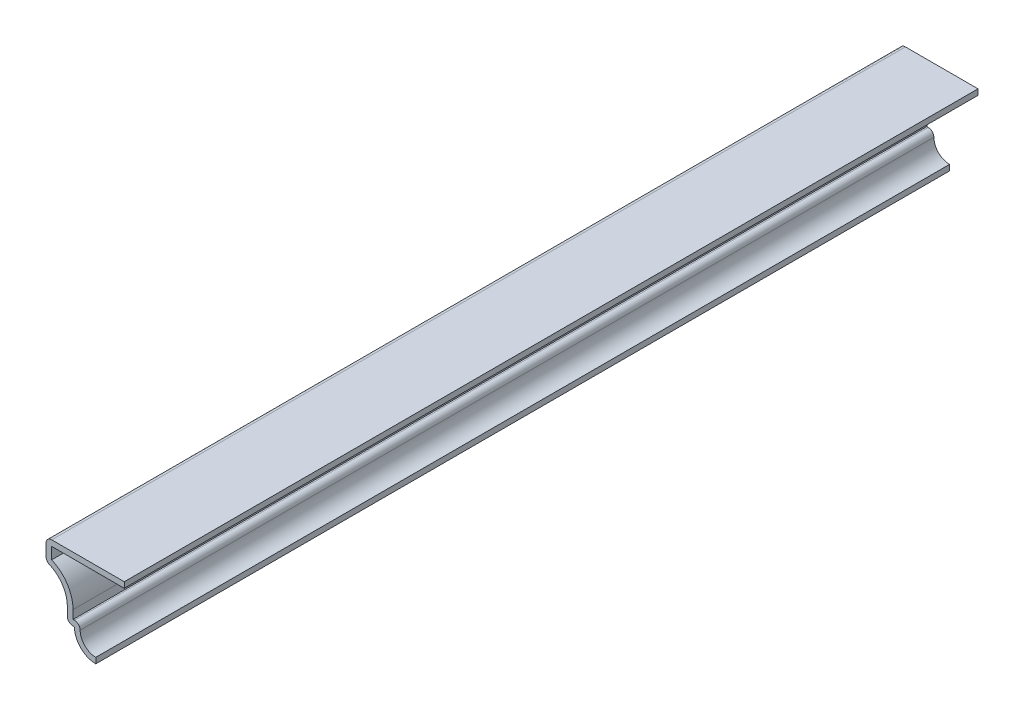
ISO-10303-21;
HEADER;
FILE_DESCRIPTION(('STEP AP214'),'2;1');
FILE_NAME('part.step','',(''),(''),'','','');
FILE_SCHEMA(('AUTOMOTIVE_DESIGN { 1 0 10303 214 1 1 1 1 }'));
ENDSEC;
DATA;
#1=APPLICATION_CONTEXT('core data for automotive mechanical design processes');
#2=APPLICATION_PROTOCOL_DEFINITION('international standard','automotive_design',2000,#1);
#3=PRODUCT_CONTEXT('',#1,'mechanical');
#4=PRODUCT('Part','Part','',(#3));
#5=PRODUCT_RELATED_PRODUCT_CATEGORY('part','',(#4));
#6=PRODUCT_DEFINITION_FORMATION('','',#4);
#7=PRODUCT_DEFINITION_CONTEXT('part definition',#1,'design');
#8=PRODUCT_DEFINITION('design','',#6,#7);
#9=PRODUCT_DEFINITION_SHAPE('','',#8);
#10=(LENGTH_UNIT() NAMED_UNIT(*) SI_UNIT(.MILLI.,.METRE.));
#11=(NAMED_UNIT(*) PLANE_ANGLE_UNIT() SI_UNIT($,.RADIAN.));
#12=(NAMED_UNIT(*) SI_UNIT($,.STERADIAN.) SOLID_ANGLE_UNIT());
#13=UNCERTAINTY_MEASURE_WITH_UNIT(LENGTH_MEASURE(1.E-05),#10,'distance_accuracy_value','');
#14=(GEOMETRIC_REPRESENTATION_CONTEXT(3) GLOBAL_UNCERTAINTY_ASSIGNED_CONTEXT((#13)) GLOBAL_UNIT_ASSIGNED_CONTEXT((#10,
#11,#12)) REPRESENTATION_CONTEXT('',''));
#15=CARTESIAN_POINT('',(0.,0.,0.));
#16=DIRECTION('',(0.,0.,1.));
#17=DIRECTION('',(1.,0.,0.));
#18=AXIS2_PLACEMENT_3D('',#15,#16,#17);
#19=CARTESIAN_POINT('',(0.,4.7625,-190.5));
#20=DIRECTION('',(0.,0.,1.));
#21=DIRECTION('',(1.,0.,0.));
#22=AXIS2_PLACEMENT_3D('',#19,#20,#21);
#23=CYLINDRICAL_SURFACE('',#22,4.7625);
#24=CARTESIAN_POINT('',(0.,4.7625,0.));
#25=DIRECTION('',(0.,0.,1.));
#26=DIRECTION('',(1.,0.,0.));
#27=AXIS2_PLACEMENT_3D('',#24,#25,#26);
#28=CIRCLE('',#27,4.7625);
#29=CARTESIAN_POINT('',(-4.7625,4.7625,0.));
#30=VERTEX_POINT('',#29);
#31=CARTESIAN_POINT('',(0.,0.,0.));
#32=VERTEX_POINT('',#31);
#33=EDGE_CURVE('E215',#30,#32,#28,.T.);
#34=ORIENTED_EDGE('',*,*,#33,.F.);
#35=DIRECTION('',(0.,0.,1.));
#36=VECTOR('',#35,1.);
#37=CARTESIAN_POINT('',(-4.7625,4.7625,-190.5));
#38=LINE('',#37,#36);
#39=CARTESIAN_POINT('',(-4.7625,4.7625,-190.5));
#40=VERTEX_POINT('',#39);
#41=EDGE_CURVE('E186',#40,#30,#38,.T.);
#42=ORIENTED_EDGE('',*,*,#41,.F.);
#43=CARTESIAN_POINT('',(0.,4.7625,-190.5));
#44=DIRECTION('',(0.,0.,1.));
#45=DIRECTION('',(1.,0.,0.));
#46=AXIS2_PLACEMENT_3D('',#43,#44,#45);
#47=CIRCLE('',#46,4.7625);
#48=CARTESIAN_POINT('',(0.,0.,-190.5));
#49=VERTEX_POINT('',#48);
#50=EDGE_CURVE('E166',#40,#49,#47,.T.);
#51=ORIENTED_EDGE('',*,*,#50,.T.);
#52=DIRECTION('',(0.,0.,1.));
#53=VECTOR('',#52,1.);
#54=CARTESIAN_POINT('',(0.,0.,-190.5));
#55=LINE('',#54,#53);
#56=EDGE_CURVE('E174',#49,#32,#55,.T.);
#57=ORIENTED_EDGE('',*,*,#56,.T.);
#58=EDGE_LOOP('',(#34,#42,#51,#57));
#59=FACE_BOUND('',#58,.T.);
#60=ADVANCED_FACE('F34',(#59),#23,.T.);
#61=CARTESIAN_POINT('',(-6.35,4.7625,-190.5));
#62=DIRECTION('',(0.,-1.,0.));
#63=DIRECTION('',(0.,0.,-1.));
#64=AXIS2_PLACEMENT_3D('',#61,#62,#63);
#65=PLANE('',#64);
#66=DIRECTION('',(1.,0.,0.));
#67=VECTOR('',#66,1.);
#68=CARTESIAN_POINT('',(-6.35,4.7625,0.));
#69=LINE('',#68,#67);
#70=CARTESIAN_POINT('',(-5.08,4.7625,0.));
#71=VERTEX_POINT('',#70);
#72=EDGE_CURVE('E187',#71,#30,#69,.T.);
#73=ORIENTED_EDGE('',*,*,#72,.F.);
#74=DIRECTION('',(0.,0.,1.));
#75=VECTOR('',#74,1.);
#76=CARTESIAN_POINT('',(-5.08,4.7625,-190.5));
#77=LINE('',#76,#75);
#78=CARTESIAN_POINT('',(-5.08,4.7625,-190.5));
#79=VERTEX_POINT('',#78);
#80=EDGE_CURVE('E287',#71,#79,#77,.F.);
#81=ORIENTED_EDGE('',*,*,#80,.T.);
#82=DIRECTION('',(1.,0.,0.));
#83=VECTOR('',#82,1.);
#84=CARTESIAN_POINT('',(-6.35,4.7625,-190.5));
#85=LINE('',#84,#83);
#86=EDGE_CURVE('E182',#79,#40,#85,.T.);
#87=ORIENTED_EDGE('',*,*,#86,.T.);
#88=ORIENTED_EDGE('',*,*,#41,.T.);
#89=EDGE_LOOP('',(#73,#81,#87,#88));
#90=FACE_BOUND('',#89,.T.);
#91=ADVANCED_FACE('F353',(#90),#65,.T.);
#92=CARTESIAN_POINT('',(-6.35,4.7625,-190.5));
#93=DIRECTION('',(-1.,0.,0.));
#94=DIRECTION('',(0.,-1.,0.));
#95=AXIS2_PLACEMENT_3D('',#92,#93,#94);
#96=PLANE('',#95);
#97=DIRECTION('',(0.,-1.,0.));
#98=VECTOR('',#97,1.);
#99=CARTESIAN_POINT('',(-6.35,4.7625,-190.5));
#100=LINE('',#99,#98);
#101=CARTESIAN_POINT('',(-6.35,7.9375,-190.5));
#102=VERTEX_POINT('',#101);
#103=CARTESIAN_POINT('',(-6.35,6.0325,-190.5));
#104=VERTEX_POINT('',#103);
#105=EDGE_CURVE('E211',#102,#104,#100,.T.);
#106=ORIENTED_EDGE('',*,*,#105,.T.);
#107=DIRECTION('',(0.,0.,1.));
#108=VECTOR('',#107,1.);
#109=CARTESIAN_POINT('',(-6.35,6.0325,-190.5));
#110=LINE('',#109,#108);
#111=CARTESIAN_POINT('',(-6.35,6.0325,0.));
#112=VERTEX_POINT('',#111);
#113=EDGE_CURVE('E284',#104,#112,#110,.T.);
#114=ORIENTED_EDGE('',*,*,#113,.T.);
#115=DIRECTION('',(0.,-1.,0.));
#116=VECTOR('',#115,1.);
#117=CARTESIAN_POINT('',(-6.35,4.7625,0.));
#118=LINE('',#117,#116);
#119=CARTESIAN_POINT('',(-6.35,7.9375,0.));
#120=VERTEX_POINT('',#119);
#121=EDGE_CURVE('E189',#120,#112,#118,.T.);
#122=ORIENTED_EDGE('',*,*,#121,.F.);
#123=DIRECTION('',(0.,0.,1.));
#124=VECTOR('',#123,1.);
#125=CARTESIAN_POINT('',(-6.35,7.9375,-190.5));
#126=LINE('',#125,#124);
#127=EDGE_CURVE('E245',#102,#120,#126,.T.);
#128=ORIENTED_EDGE('',*,*,#127,.F.);
#129=EDGE_LOOP('',(#106,#114,#122,#128));
#130=FACE_BOUND('',#129,.T.);
#131=ADVANCED_FACE('F360',(#130),#96,.T.);
#132=CARTESIAN_POINT('',(-12.9645833333333,7.9375,-190.5));
#133=DIRECTION('',(0.,0.,1.));
#134=DIRECTION('',(1.,0.,0.));
#135=AXIS2_PLACEMENT_3D('',#132,#133,#134);
#136=CYLINDRICAL_SURFACE('',#135,6.61458333333333);
#137=CARTESIAN_POINT('',(-12.9645833333333,7.9375,0.));
#138=DIRECTION('',(0.,0.,-1.));
#139=DIRECTION('',(-1.,0.,0.));
#140=AXIS2_PLACEMENT_3D('',#137,#138,#139);
#141=CIRCLE('',#140,6.61458333333333);
#142=CARTESIAN_POINT('',(-10.3453859060403,14.0114210984728,0.));
#143=VERTEX_POINT('',#142);
#144=EDGE_CURVE('E239',#143,#120,#141,.T.);
#145=ORIENTED_EDGE('',*,*,#144,.F.);
#146=DIRECTION('',(0.,0.,1.));
#147=VECTOR('',#146,1.);
#148=CARTESIAN_POINT('',(-10.3453859060403,14.0114210984728,-190.5));
#149=LINE('',#148,#147);
#150=CARTESIAN_POINT('',(-10.3453859060403,14.0114210984728,-190.5));
#151=VERTEX_POINT('',#150);
#152=EDGE_CURVE('E42',#143,#151,#149,.F.);
#153=ORIENTED_EDGE('',*,*,#152,.T.);
#154=CARTESIAN_POINT('',(-12.9645833333333,7.9375,-190.5));
#155=DIRECTION('',(0.,0.,-1.));
#156=DIRECTION('',(-1.,0.,0.));
#157=AXIS2_PLACEMENT_3D('',#154,#155,#156);
#158=CIRCLE('',#157,6.61458333333333);
#159=EDGE_CURVE('E209',#151,#102,#158,.T.);
#160=ORIENTED_EDGE('',*,*,#159,.T.);
#161=ORIENTED_EDGE('',*,*,#127,.T.);
#162=EDGE_LOOP('',(#145,#153,#160,#161));
#163=FACE_BOUND('',#162,.T.);
#164=ADVANCED_FACE('F296',(#163),#136,.F.);
#165=CARTESIAN_POINT('',(-11.1125,19.05,-190.5));
#166=DIRECTION('',(-1.,0.,0.));
#167=DIRECTION('',(0.,0.,1.));
#168=AXIS2_PLACEMENT_3D('',#165,#166,#167);
#169=PLANE('',#168);
#170=DIRECTION('',(0.,-1.,0.));
#171=VECTOR('',#170,1.);
#172=CARTESIAN_POINT('',(-11.1125,19.05,-190.5));
#173=LINE('',#172,#171);
#174=CARTESIAN_POINT('',(-11.1125,17.78,-190.5));
#175=VERTEX_POINT('',#174);
#176=CARTESIAN_POINT('',(-11.1125,15.1776139493795,-190.5));
#177=VERTEX_POINT('',#176);
#178=EDGE_CURVE('E207',#175,#177,#173,.T.);
#179=ORIENTED_EDGE('',*,*,#178,.T.);
#180=DIRECTION('',(0.,0.,1.));
#181=VECTOR('',#180,1.);
#182=CARTESIAN_POINT('',(-11.1125,15.1776139493795,-190.5));
#183=LINE('',#182,#181);
#184=CARTESIAN_POINT('',(-11.1125,15.1776139493795,0.));
#185=VERTEX_POINT('',#184);
#186=EDGE_CURVE('E291',#177,#185,#183,.T.);
#187=ORIENTED_EDGE('',*,*,#186,.T.);
#188=DIRECTION('',(0.,-1.,0.));
#189=VECTOR('',#188,1.);
#190=CARTESIAN_POINT('',(-11.1125,19.05,0.));
#191=LINE('',#190,#189);
#192=CARTESIAN_POINT('',(-11.1125,17.78,0.));
#193=VERTEX_POINT('',#192);
#194=EDGE_CURVE('E236',#193,#185,#191,.T.);
#195=ORIENTED_EDGE('',*,*,#194,.F.);
#196=DIRECTION('',(0.,0.,1.));
#197=VECTOR('',#196,1.);
#198=CARTESIAN_POINT('',(-11.1125,17.78,-190.5));
#199=LINE('',#198,#197);
#200=EDGE_CURVE('E289',#193,#175,#199,.F.);
#201=ORIENTED_EDGE('',*,*,#200,.T.);
#202=EDGE_LOOP('',(#179,#187,#195,#201));
#203=FACE_BOUND('',#202,.T.);
#204=ADVANCED_FACE('F304',(#203),#169,.T.);
#205=CARTESIAN_POINT('',(6.35,19.05,-190.5));
#206=DIRECTION('',(0.,1.,0.));
#207=DIRECTION('',(0.,0.,1.));
#208=AXIS2_PLACEMENT_3D('',#205,#206,#207);
#209=PLANE('',#208);
#210=DIRECTION('',(-1.,0.,0.));
#211=VECTOR('',#210,1.);
#212=CARTESIAN_POINT('',(6.35,19.05,-190.5));
#213=LINE('',#212,#211);
#214=CARTESIAN_POINT('',(6.35,19.05,-190.5));
#215=VERTEX_POINT('',#214);
#216=CARTESIAN_POINT('',(-9.8425,19.05,-190.5));
#217=VERTEX_POINT('',#216);
#218=EDGE_CURVE('E205',#215,#217,#213,.T.);
#219=ORIENTED_EDGE('',*,*,#218,.T.);
#220=DIRECTION('',(0.,0.,1.));
#221=VECTOR('',#220,1.);
#222=CARTESIAN_POINT('',(-9.8425,19.05,-190.5));
#223=LINE('',#222,#221);
#224=CARTESIAN_POINT('',(-9.8425,19.05,0.));
#225=VERTEX_POINT('',#224);
#226=EDGE_CURVE('E11',#217,#225,#223,.T.);
#227=ORIENTED_EDGE('',*,*,#226,.T.);
#228=DIRECTION('',(-1.,0.,0.));
#229=VECTOR('',#228,1.);
#230=CARTESIAN_POINT('',(6.35,19.05,0.));
#231=LINE('',#230,#229);
#232=CARTESIAN_POINT('',(6.35,19.05,0.));
#233=VERTEX_POINT('',#232);
#234=EDGE_CURVE('E233',#233,#225,#231,.T.);
#235=ORIENTED_EDGE('',*,*,#234,.F.);
#236=DIRECTION('',(0.,0.,1.));
#237=VECTOR('',#236,1.);
#238=CARTESIAN_POINT('',(6.35,19.05,-190.5));
#239=LINE('',#238,#237);
#240=EDGE_CURVE('E248',#215,#233,#239,.T.);
#241=ORIENTED_EDGE('',*,*,#240,.F.);
#242=EDGE_LOOP('',(#219,#227,#235,#241));
#243=FACE_BOUND('',#242,.T.);
#244=ADVANCED_FACE('F314',(#243),#209,.T.);
#245=CARTESIAN_POINT('',(6.35,19.05,-190.5));
#246=DIRECTION('',(-1.,0.,0.));
#247=DIRECTION('',(0.,0.,1.));
#248=AXIS2_PLACEMENT_3D('',#245,#246,#247);
#249=PLANE('',#248);
#250=DIRECTION('',(0.,-1.,0.));
#251=VECTOR('',#250,1.);
#252=CARTESIAN_POINT('',(6.35,19.05,0.));
#253=LINE('',#252,#251);
#254=CARTESIAN_POINT('',(6.35,17.78,0.));
#255=VERTEX_POINT('',#254);
#256=EDGE_CURVE('E231',#233,#255,#253,.T.);
#257=ORIENTED_EDGE('',*,*,#256,.T.);
#258=DIRECTION('',(0.,0.,1.));
#259=VECTOR('',#258,1.);
#260=CARTESIAN_POINT('',(6.35,17.78,-190.5));
#261=LINE('',#260,#259);
#262=CARTESIAN_POINT('',(6.35,17.78,-190.5));
#263=VERTEX_POINT('',#262);
#264=EDGE_CURVE('E250',#263,#255,#261,.T.);
#265=ORIENTED_EDGE('',*,*,#264,.F.);
#266=DIRECTION('',(0.,-1.,0.));
#267=VECTOR('',#266,1.);
#268=CARTESIAN_POINT('',(6.35,19.05,-190.5));
#269=LINE('',#268,#267);
#270=EDGE_CURVE('E203',#215,#263,#269,.T.);
#271=ORIENTED_EDGE('',*,*,#270,.F.);
#272=ORIENTED_EDGE('',*,*,#240,.T.);
#273=EDGE_LOOP('',(#257,#265,#271,#272));
#274=FACE_BOUND('',#273,.T.);
#275=ADVANCED_FACE('F320',(#274),#249,.F.);
#276=CARTESIAN_POINT('',(6.35,17.78,-190.5));
#277=DIRECTION('',(0.,1.,0.));
#278=DIRECTION('',(0.,0.,1.));
#279=AXIS2_PLACEMENT_3D('',#276,#277,#278);
#280=PLANE('',#279);
#281=DIRECTION('',(1.,0.,0.));
#282=VECTOR('',#281,1.);
#283=CARTESIAN_POINT('',(6.35,17.78,0.));
#284=LINE('',#283,#282);
#285=CARTESIAN_POINT('',(-9.8425,17.78,0.));
#286=VERTEX_POINT('',#285);
#287=EDGE_CURVE('E229',#255,#286,#284,.F.);
#288=ORIENTED_EDGE('',*,*,#287,.T.);
#289=DIRECTION('',(0.,0.,1.));
#290=VECTOR('',#289,1.);
#291=CARTESIAN_POINT('',(-9.8425,17.78,-190.5));
#292=LINE('',#291,#290);
#293=CARTESIAN_POINT('',(-9.8425,17.78,-190.5));
#294=VERTEX_POINT('',#293);
#295=EDGE_CURVE('E253',#294,#286,#292,.T.);
#296=ORIENTED_EDGE('',*,*,#295,.F.);
#297=DIRECTION('',(1.,0.,0.));
#298=VECTOR('',#297,1.);
#299=CARTESIAN_POINT('',(6.35,17.78,-190.5));
#300=LINE('',#299,#298);
#301=EDGE_CURVE('E201',#263,#294,#300,.F.);
#302=ORIENTED_EDGE('',*,*,#301,.F.);
#303=ORIENTED_EDGE('',*,*,#264,.T.);
#304=EDGE_LOOP('',(#288,#296,#302,#303));
#305=FACE_BOUND('',#304,.T.);
#306=ADVANCED_FACE('F323',(#305),#280,.F.);
#307=CARTESIAN_POINT('',(-9.8425,19.05,-190.5));
#308=DIRECTION('',(-1.,0.,0.));
#309=DIRECTION('',(0.,0.,1.));
#310=AXIS2_PLACEMENT_3D('',#307,#308,#309);
#311=PLANE('',#310);
#312=DIRECTION('',(0.,1.,0.));
#313=VECTOR('',#312,1.);
#314=CARTESIAN_POINT('',(-9.8425,19.05,0.));
#315=LINE('',#314,#313);
#316=CARTESIAN_POINT('',(-9.8425,15.1776139493795,0.));
#317=VERTEX_POINT('',#316);
#318=EDGE_CURVE('E227',#286,#317,#315,.F.);
#319=ORIENTED_EDGE('',*,*,#318,.T.);
#320=DIRECTION('',(0.,0.,1.));
#321=VECTOR('',#320,1.);
#322=CARTESIAN_POINT('',(-9.8425,15.1776139493795,-190.5));
#323=LINE('',#322,#321);
#324=CARTESIAN_POINT('',(-9.8425,15.1776139493795,-190.5));
#325=VERTEX_POINT('',#324);
#326=EDGE_CURVE('E256',#325,#317,#323,.T.);
#327=ORIENTED_EDGE('',*,*,#326,.F.);
#328=DIRECTION('',(0.,1.,0.));
#329=VECTOR('',#328,1.);
#330=CARTESIAN_POINT('',(-9.8425,19.05,-190.5));
#331=LINE('',#330,#329);
#332=EDGE_CURVE('E199',#294,#325,#331,.F.);
#333=ORIENTED_EDGE('',*,*,#332,.F.);
#334=ORIENTED_EDGE('',*,*,#295,.T.);
#335=EDGE_LOOP('',(#319,#327,#333,#334));
#336=FACE_BOUND('',#335,.T.);
#337=ADVANCED_FACE('F328',(#336),#311,.F.);
#338=CARTESIAN_POINT('',(-12.9645833333333,7.9375,-190.5));
#339=DIRECTION('',(0.,0.,1.));
#340=DIRECTION('',(1.,0.,0.));
#341=AXIS2_PLACEMENT_3D('',#338,#339,#340);
#342=CYLINDRICAL_SURFACE('',#341,7.88458333333334);
#343=CARTESIAN_POINT('',(-12.9645833333333,7.9375,0.));
#344=DIRECTION('',(0.,0.,1.));
#345=DIRECTION('',(1.,0.,0.));
#346=AXIS2_PLACEMENT_3D('',#343,#344,#345);
#347=CIRCLE('',#346,7.88458333333334);
#348=CARTESIAN_POINT('',(-5.08,7.9375,0.));
#349=VERTEX_POINT('',#348);
#350=EDGE_CURVE('E225',#317,#349,#347,.F.);
#351=ORIENTED_EDGE('',*,*,#350,.T.);
#352=DIRECTION('',(0.,0.,1.));
#353=VECTOR('',#352,1.);
#354=CARTESIAN_POINT('',(-5.08,7.9375,-190.5));
#355=LINE('',#354,#353);
#356=CARTESIAN_POINT('',(-5.08,7.9375,-190.5));
#357=VERTEX_POINT('',#356);
#358=EDGE_CURVE('E259',#357,#349,#355,.T.);
#359=ORIENTED_EDGE('',*,*,#358,.F.);
#360=CARTESIAN_POINT('',(-12.9645833333333,7.9375,-190.5));
#361=DIRECTION('',(0.,0.,1.));
#362=DIRECTION('',(1.,0.,0.));
#363=AXIS2_PLACEMENT_3D('',#360,#361,#362);
#364=CIRCLE('',#363,7.88458333333334);
#365=EDGE_CURVE('E197',#325,#357,#364,.F.);
#366=ORIENTED_EDGE('',*,*,#365,.F.);
#367=ORIENTED_EDGE('',*,*,#326,.T.);
#368=EDGE_LOOP('',(#351,#359,#366,#367));
#369=FACE_BOUND('',#368,.T.);
#370=ADVANCED_FACE('F334',(#369),#342,.T.);
#371=CARTESIAN_POINT('',(-5.08,4.7625,-190.5));
#372=DIRECTION('',(-1.,0.,0.));
#373=DIRECTION('',(0.,-1.,0.));
#374=AXIS2_PLACEMENT_3D('',#371,#372,#373);
#375=PLANE('',#374);
#376=DIRECTION('',(0.,-1.,0.));
#377=VECTOR('',#376,1.);
#378=CARTESIAN_POINT('',(-5.08,4.7625,0.));
#379=LINE('',#378,#377);
#380=CARTESIAN_POINT('',(-5.08,6.0325,0.));
#381=VERTEX_POINT('',#380);
#382=EDGE_CURVE('E223',#349,#381,#379,.T.);
#383=ORIENTED_EDGE('',*,*,#382,.T.);
#384=DIRECTION('',(0.,0.,1.));
#385=VECTOR('',#384,1.);
#386=CARTESIAN_POINT('',(-5.08,6.0325,-190.5));
#387=LINE('',#386,#385);
#388=CARTESIAN_POINT('',(-5.08,6.0325,-190.5));
#389=VERTEX_POINT('',#388);
#390=EDGE_CURVE('E262',#389,#381,#387,.T.);
#391=ORIENTED_EDGE('',*,*,#390,.F.);
#392=DIRECTION('',(0.,-1.,0.));
#393=VECTOR('',#392,1.);
#394=CARTESIAN_POINT('',(-5.08,4.7625,-190.5));
#395=LINE('',#394,#393);
#396=EDGE_CURVE('E195',#357,#389,#395,.T.);
#397=ORIENTED_EDGE('',*,*,#396,.F.);
#398=ORIENTED_EDGE('',*,*,#358,.T.);
#399=EDGE_LOOP('',(#383,#391,#397,#398));
#400=FACE_BOUND('',#399,.T.);
#401=ADVANCED_FACE('F338',(#400),#375,.F.);
#402=CARTESIAN_POINT('',(-6.35,6.0325,-190.5));
#403=DIRECTION('',(0.,-1.,0.));
#404=DIRECTION('',(0.,0.,-1.));
#405=AXIS2_PLACEMENT_3D('',#402,#403,#404);
#406=PLANE('',#405);
#407=DIRECTION('',(1.,0.,0.));
#408=VECTOR('',#407,1.);
#409=CARTESIAN_POINT('',(-6.35,6.0325,0.));
#410=LINE('',#409,#408);
#411=CARTESIAN_POINT('',(-4.7625,6.0325,0.));
#412=VERTEX_POINT('',#411);
#413=EDGE_CURVE('E220',#381,#412,#410,.T.);
#414=ORIENTED_EDGE('',*,*,#413,.T.);
#415=DIRECTION('',(0.,0.,1.));
#416=VECTOR('',#415,1.);
#417=CARTESIAN_POINT('',(-4.7625,6.0325,-190.5));
#418=LINE('',#417,#416);
#419=CARTESIAN_POINT('',(-4.7625,6.0325,-190.5));
#420=VERTEX_POINT('',#419);
#421=EDGE_CURVE('E276',#412,#420,#418,.F.);
#422=ORIENTED_EDGE('',*,*,#421,.T.);
#423=DIRECTION('',(1.,0.,0.));
#424=VECTOR('',#423,1.);
#425=CARTESIAN_POINT('',(-6.35,6.0325,-190.5));
#426=LINE('',#425,#424);
#427=EDGE_CURVE('E193',#389,#420,#426,.T.);
#428=ORIENTED_EDGE('',*,*,#427,.F.);
#429=ORIENTED_EDGE('',*,*,#390,.T.);
#430=EDGE_LOOP('',(#414,#422,#428,#429));
#431=FACE_BOUND('',#430,.T.);
#432=ADVANCED_FACE('F342',(#431),#406,.F.);
#433=CARTESIAN_POINT('',(0.,4.7625,-190.5));
#434=DIRECTION('',(0.,0.,1.));
#435=DIRECTION('',(1.,0.,0.));
#436=AXIS2_PLACEMENT_3D('',#433,#434,#435);
#437=CYLINDRICAL_SURFACE('',#436,3.4925);
#438=CARTESIAN_POINT('',(0.,4.7625,-190.5));
#439=DIRECTION('',(0.,0.,1.));
#440=DIRECTION('',(1.,0.,0.));
#441=AXIS2_PLACEMENT_3D('',#438,#439,#440);
#442=CIRCLE('',#441,3.4925);
#443=CARTESIAN_POINT('',(-3.4925,4.7625,-190.5));
#444=VERTEX_POINT('',#443);
#445=CARTESIAN_POINT('',(0.,1.27,-190.5));
#446=VERTEX_POINT('',#445);
#447=EDGE_CURVE('E168',#444,#446,#442,.T.);
#448=ORIENTED_EDGE('',*,*,#447,.F.);
#449=DIRECTION('',(0.,0.,1.));
#450=VECTOR('',#449,1.);
#451=CARTESIAN_POINT('',(-3.4925,4.7625,-190.5));
#452=LINE('',#451,#450);
#453=CARTESIAN_POINT('',(-3.4925,4.7625,0.));
#454=VERTEX_POINT('',#453);
#455=EDGE_CURVE('E244',#444,#454,#452,.T.);
#456=ORIENTED_EDGE('',*,*,#455,.T.);
#457=CARTESIAN_POINT('',(0.,4.7625,0.));
#458=DIRECTION('',(0.,0.,1.));
#459=DIRECTION('',(1.,0.,0.));
#460=AXIS2_PLACEMENT_3D('',#457,#458,#459);
#461=CIRCLE('',#460,3.4925);
#462=CARTESIAN_POINT('',(0.,1.27,0.));
#463=VERTEX_POINT('',#462);
#464=EDGE_CURVE('E218',#454,#463,#461,.T.);
#465=ORIENTED_EDGE('',*,*,#464,.T.);
#466=DIRECTION('',(0.,0.,1.));
#467=VECTOR('',#466,1.);
#468=CARTESIAN_POINT('',(0.,1.27,-190.5));
#469=LINE('',#468,#467);
#470=EDGE_CURVE('E181',#446,#463,#469,.T.);
#471=ORIENTED_EDGE('',*,*,#470,.F.);
#472=EDGE_LOOP('',(#448,#456,#465,#471));
#473=FACE_BOUND('',#472,.T.);
#474=ADVANCED_FACE('F349',(#473),#437,.F.);
#475=CARTESIAN_POINT('',(0.,1.27,-190.5));
#476=DIRECTION('',(-1.,0.,0.));
#477=DIRECTION('',(0.,-1.,0.));
#478=AXIS2_PLACEMENT_3D('',#475,#476,#477);
#479=PLANE('',#478);
#480=DIRECTION('',(0.,-1.,0.));
#481=VECTOR('',#480,1.);
#482=CARTESIAN_POINT('',(0.,1.27,0.));
#483=LINE('',#482,#481);
#484=EDGE_CURVE('E177',#463,#32,#483,.T.);
#485=ORIENTED_EDGE('',*,*,#484,.T.);
#486=ORIENTED_EDGE('',*,*,#56,.F.);
#487=DIRECTION('',(0.,-1.,0.));
#488=VECTOR('',#487,1.);
#489=CARTESIAN_POINT('',(0.,1.27,-190.5));
#490=LINE('',#489,#488);
#491=EDGE_CURVE('E160',#446,#49,#490,.T.);
#492=ORIENTED_EDGE('',*,*,#491,.F.);
#493=ORIENTED_EDGE('',*,*,#470,.T.);
#494=EDGE_LOOP('',(#485,#486,#492,#493));
#495=FACE_BOUND('',#494,.T.);
#496=ADVANCED_FACE('F175',(#495),#479,.F.);
#497=CARTESIAN_POINT('',(0.,4.7625,-190.5));
#498=DIRECTION('',(0.,0.,1.));
#499=DIRECTION('',(1.,0.,0.));
#500=AXIS2_PLACEMENT_3D('',#497,#498,#499);
#501=PLANE('',#500);
#502=ORIENTED_EDGE('',*,*,#427,.T.);
#503=CARTESIAN_POINT('',(-4.7625,4.7625,-190.5));
#504=DIRECTION('',(0.,0.,1.));
#505=DIRECTION('',(1.,0.,0.));
#506=AXIS2_PLACEMENT_3D('',#503,#504,#505);
#507=CIRCLE('',#506,1.27);
#508=EDGE_CURVE('E282',#420,#444,#507,.F.);
#509=ORIENTED_EDGE('',*,*,#508,.T.);
#510=ORIENTED_EDGE('',*,*,#447,.T.);
#511=ORIENTED_EDGE('',*,*,#491,.T.);
#512=ORIENTED_EDGE('',*,*,#50,.F.);
#513=ORIENTED_EDGE('',*,*,#86,.F.);
#514=CARTESIAN_POINT('',(-5.08,6.0325,-190.5));
#515=DIRECTION('',(0.,0.,1.));
#516=DIRECTION('',(1.,0.,0.));
#517=AXIS2_PLACEMENT_3D('',#514,#515,#516);
#518=CIRCLE('',#517,1.27);
#519=EDGE_CURVE('E280',#79,#104,#518,.F.);
#520=ORIENTED_EDGE('',*,*,#519,.T.);
#521=ORIENTED_EDGE('',*,*,#105,.F.);
#522=ORIENTED_EDGE('',*,*,#159,.F.);
#523=CARTESIAN_POINT('',(-9.8425,15.1776139493795,-190.5));
#524=DIRECTION('',(0.,0.,1.));
#525=DIRECTION('',(1.,0.,0.));
#526=AXIS2_PLACEMENT_3D('',#523,#524,#525);
#527=CIRCLE('',#526,1.27);
#528=EDGE_CURVE('E55',#151,#177,#527,.F.);
#529=ORIENTED_EDGE('',*,*,#528,.T.);
#530=ORIENTED_EDGE('',*,*,#178,.F.);
#531=CARTESIAN_POINT('',(-9.8425,17.78,-190.5));
#532=DIRECTION('',(0.,0.,1.));
#533=DIRECTION('',(1.,0.,0.));
#534=AXIS2_PLACEMENT_3D('',#531,#532,#533);
#535=CIRCLE('',#534,1.27);
#536=EDGE_CURVE('E49',#175,#217,#535,.F.);
#537=ORIENTED_EDGE('',*,*,#536,.T.);
#538=ORIENTED_EDGE('',*,*,#218,.F.);
#539=ORIENTED_EDGE('',*,*,#270,.T.);
#540=ORIENTED_EDGE('',*,*,#301,.T.);
#541=ORIENTED_EDGE('',*,*,#332,.T.);
#542=ORIENTED_EDGE('',*,*,#365,.T.);
#543=ORIENTED_EDGE('',*,*,#396,.T.);
#544=EDGE_LOOP('',(#502,#509,#510,#511,#512,#513,#520,#521,#522,#529,#530,#537,#538,#539,#540,
#541,#542,#543));
#545=FACE_BOUND('',#544,.T.);
#546=ADVANCED_FACE('F163',(#545),#501,.F.);
#547=CARTESIAN_POINT('',(0.,4.7625,0.));
#548=DIRECTION('',(0.,0.,1.));
#549=DIRECTION('',(1.,0.,0.));
#550=AXIS2_PLACEMENT_3D('',#547,#548,#549);
#551=PLANE('',#550);
#552=ORIENTED_EDGE('',*,*,#464,.F.);
#553=CARTESIAN_POINT('',(-4.7625,4.7625,0.));
#554=DIRECTION('',(0.,0.,1.));
#555=DIRECTION('',(1.,0.,0.));
#556=AXIS2_PLACEMENT_3D('',#553,#554,#555);
#557=CIRCLE('',#556,1.27);
#558=EDGE_CURVE('E274',#454,#412,#557,.T.);
#559=ORIENTED_EDGE('',*,*,#558,.T.);
#560=ORIENTED_EDGE('',*,*,#413,.F.);
#561=ORIENTED_EDGE('',*,*,#382,.F.);
#562=ORIENTED_EDGE('',*,*,#350,.F.);
#563=ORIENTED_EDGE('',*,*,#318,.F.);
#564=ORIENTED_EDGE('',*,*,#287,.F.);
#565=ORIENTED_EDGE('',*,*,#256,.F.);
#566=ORIENTED_EDGE('',*,*,#234,.T.);
#567=CARTESIAN_POINT('',(-9.8425,17.78,0.));
#568=DIRECTION('',(0.,0.,1.));
#569=DIRECTION('',(1.,0.,0.));
#570=AXIS2_PLACEMENT_3D('',#567,#568,#569);
#571=CIRCLE('',#570,1.27);
#572=EDGE_CURVE('E268',#225,#193,#571,.T.);
#573=ORIENTED_EDGE('',*,*,#572,.T.);
#574=ORIENTED_EDGE('',*,*,#194,.T.);
#575=CARTESIAN_POINT('',(-9.8425,15.1776139493795,0.));
#576=DIRECTION('',(0.,0.,1.));
#577=DIRECTION('',(1.,0.,0.));
#578=AXIS2_PLACEMENT_3D('',#575,#576,#577);
#579=CIRCLE('',#578,1.27);
#580=EDGE_CURVE('E270',#185,#143,#579,.T.);
#581=ORIENTED_EDGE('',*,*,#580,.T.);
#582=ORIENTED_EDGE('',*,*,#144,.T.);
#583=ORIENTED_EDGE('',*,*,#121,.T.);
#584=CARTESIAN_POINT('',(-5.08,6.0325,0.));
#585=DIRECTION('',(0.,0.,1.));
#586=DIRECTION('',(1.,0.,0.));
#587=AXIS2_PLACEMENT_3D('',#584,#585,#586);
#588=CIRCLE('',#587,1.27);
#589=EDGE_CURVE('E272',#112,#71,#588,.T.);
#590=ORIENTED_EDGE('',*,*,#589,.T.);
#591=ORIENTED_EDGE('',*,*,#72,.T.);
#592=ORIENTED_EDGE('',*,*,#33,.T.);
#593=ORIENTED_EDGE('',*,*,#484,.F.);
#594=EDGE_LOOP('',(#552,#559,#560,#561,#562,#563,#564,#565,#566,#573,#574,#581,#582,#583,#590,
#591,#592,#593));
#595=FACE_BOUND('',#594,.T.);
#596=ADVANCED_FACE('F308',(#595),#551,.T.);
#597=CARTESIAN_POINT('',(-4.7625,4.7625,-190.5));
#598=DIRECTION('',(0.,0.,1.));
#599=DIRECTION('',(1.,0.,0.));
#600=AXIS2_PLACEMENT_3D('',#597,#598,#599);
#601=CYLINDRICAL_SURFACE('',#600,1.27);
#602=ORIENTED_EDGE('',*,*,#508,.F.);
#603=ORIENTED_EDGE('',*,*,#421,.F.);
#604=ORIENTED_EDGE('',*,*,#558,.F.);
#605=ORIENTED_EDGE('',*,*,#455,.F.);
#606=EDGE_LOOP('',(#602,#603,#604,#605));
#607=FACE_BOUND('',#606,.T.);
#608=ADVANCED_FACE('F347',(#607),#601,.T.);
#609=CARTESIAN_POINT('',(-5.08,6.0325,-190.5));
#610=DIRECTION('',(0.,0.,1.));
#611=DIRECTION('',(1.,0.,0.));
#612=AXIS2_PLACEMENT_3D('',#609,#610,#611);
#613=CYLINDRICAL_SURFACE('',#612,1.27);
#614=ORIENTED_EDGE('',*,*,#519,.F.);
#615=ORIENTED_EDGE('',*,*,#80,.F.);
#616=ORIENTED_EDGE('',*,*,#589,.F.);
#617=ORIENTED_EDGE('',*,*,#113,.F.);
#618=EDGE_LOOP('',(#614,#615,#616,#617));
#619=FACE_BOUND('',#618,.T.);
#620=ADVANCED_FACE('F357',(#619),#613,.T.);
#621=CARTESIAN_POINT('',(-9.8425,15.1776139493795,-190.5));
#622=DIRECTION('',(0.,0.,1.));
#623=DIRECTION('',(1.,0.,0.));
#624=AXIS2_PLACEMENT_3D('',#621,#622,#623);
#625=CYLINDRICAL_SURFACE('',#624,1.27);
#626=ORIENTED_EDGE('',*,*,#528,.F.);
#627=ORIENTED_EDGE('',*,*,#152,.F.);
#628=ORIENTED_EDGE('',*,*,#580,.F.);
#629=ORIENTED_EDGE('',*,*,#186,.F.);
#630=EDGE_LOOP('',(#626,#627,#628,#629));
#631=FACE_BOUND('',#630,.T.);
#632=ADVANCED_FACE('F301',(#631),#625,.T.);
#633=CARTESIAN_POINT('',(-9.8425,17.78,-190.5));
#634=DIRECTION('',(0.,0.,1.));
#635=DIRECTION('',(1.,0.,0.));
#636=AXIS2_PLACEMENT_3D('',#633,#634,#635);
#637=CYLINDRICAL_SURFACE('',#636,1.27);
#638=ORIENTED_EDGE('',*,*,#536,.F.);
#639=ORIENTED_EDGE('',*,*,#200,.F.);
#640=ORIENTED_EDGE('',*,*,#572,.F.);
#641=ORIENTED_EDGE('',*,*,#226,.F.);
#642=EDGE_LOOP('',(#638,#639,#640,#641));
#643=FACE_BOUND('',#642,.T.);
#644=ADVANCED_FACE('F36',(#643),#637,.T.);
#645=CLOSED_SHELL('',(#60,#91,#131,#164,#204,#244,#275,#306,#337,#370,#401,#432,#474,#496,#546,
#596,#608,#620,#632,#644));
#646=MANIFOLD_SOLID_BREP('B2',#645);
#647=ADVANCED_BREP_SHAPE_REPRESENTATION('',(#18,#646),#14);
#648=SHAPE_DEFINITION_REPRESENTATION(#9,#647);
ENDSEC;
END-ISO-10303-21;
